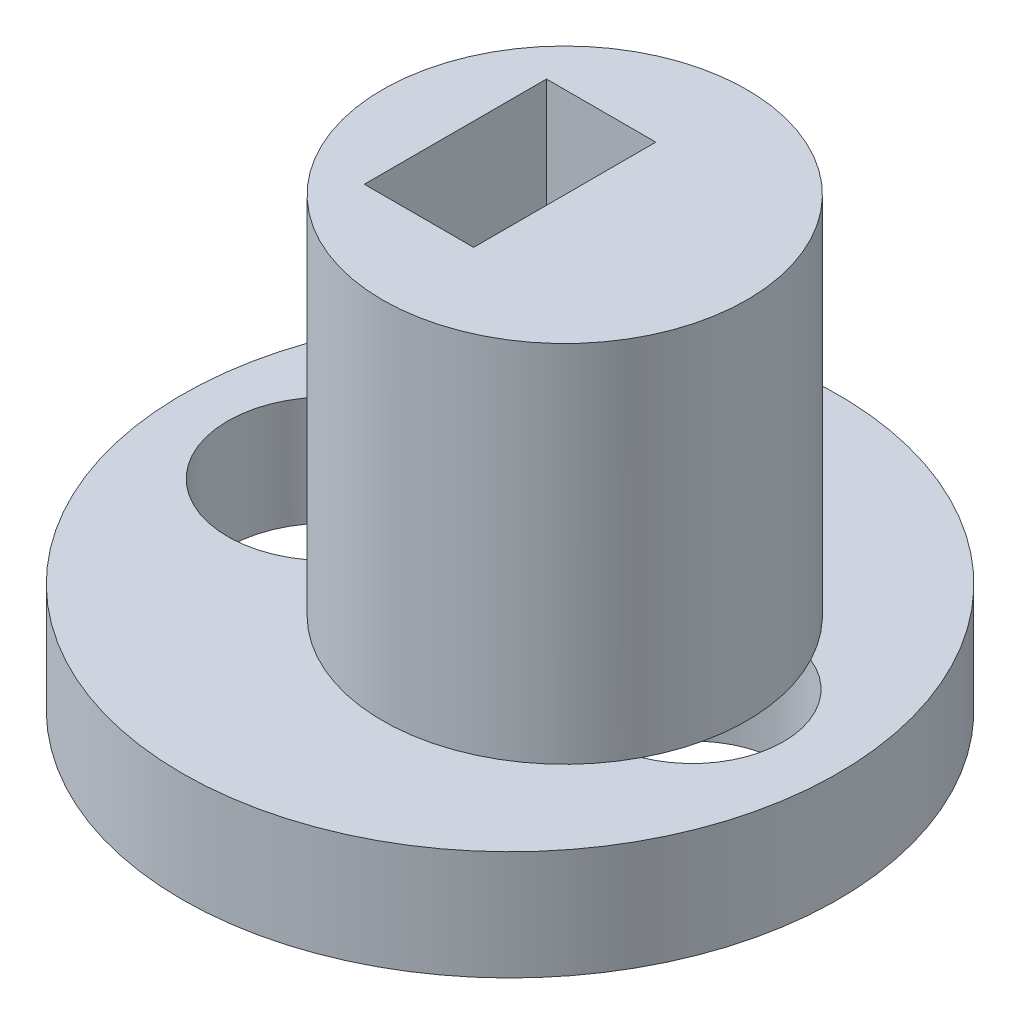
ISO-10303-21;
HEADER;
FILE_DESCRIPTION(('STEP AP214'),'2;1');
FILE_NAME('part.step','',(''),(''),'','','');
FILE_SCHEMA(('AUTOMOTIVE_DESIGN { 1 0 10303 214 1 1 1 1 }'));
ENDSEC;
DATA;
#1=APPLICATION_CONTEXT('core data for automotive mechanical design processes');
#2=APPLICATION_PROTOCOL_DEFINITION('international standard','automotive_design',2000,#1);
#3=PRODUCT_CONTEXT('',#1,'mechanical');
#4=PRODUCT('Part','Part','',(#3));
#5=PRODUCT_RELATED_PRODUCT_CATEGORY('part','',(#4));
#6=PRODUCT_DEFINITION_FORMATION('','',#4);
#7=PRODUCT_DEFINITION_CONTEXT('part definition',#1,'design');
#8=PRODUCT_DEFINITION('design','',#6,#7);
#9=PRODUCT_DEFINITION_SHAPE('','',#8);
#10=(LENGTH_UNIT() NAMED_UNIT(*) SI_UNIT(.MILLI.,.METRE.));
#11=(NAMED_UNIT(*) PLANE_ANGLE_UNIT() SI_UNIT($,.RADIAN.));
#12=(NAMED_UNIT(*) SI_UNIT($,.STERADIAN.) SOLID_ANGLE_UNIT());
#13=UNCERTAINTY_MEASURE_WITH_UNIT(LENGTH_MEASURE(1.E-05),#10,'distance_accuracy_value','');
#14=(GEOMETRIC_REPRESENTATION_CONTEXT(3) GLOBAL_UNCERTAINTY_ASSIGNED_CONTEXT((#13)) GLOBAL_UNIT_ASSIGNED_CONTEXT((#10,
#11,#12)) REPRESENTATION_CONTEXT('',''));
#15=CARTESIAN_POINT('',(0.,0.,0.));
#16=DIRECTION('',(0.,0.,1.));
#17=DIRECTION('',(1.,0.,0.));
#18=AXIS2_PLACEMENT_3D('',#15,#16,#17);
#19=CARTESIAN_POINT('',(0.,3.,0.));
#20=DIRECTION('',(0.,1.,0.));
#21=DIRECTION('',(0.,0.,1.));
#22=AXIS2_PLACEMENT_3D('',#19,#20,#21);
#23=PLANE('',#22);
#24=CARTESIAN_POINT('',(1.5,3.,0.));
#25=DIRECTION('',(0.,1.,0.));
#26=DIRECTION('',(0.,0.,1.));
#27=AXIS2_PLACEMENT_3D('',#24,#25,#26);
#28=CIRCLE('',#27,5.);
#29=CARTESIAN_POINT('',(5.92857142857143,3.,-2.32115382989599));
#30=VERTEX_POINT('',#29);
#31=CARTESIAN_POINT('',(-3.09109173493235,3.,-1.98037286424448));
#32=VERTEX_POINT('',#31);
#33=EDGE_CURVE('E11',#30,#32,#28,.T.);
#34=ORIENTED_EDGE('',*,*,#33,.F.);
#35=CARTESIAN_POINT('',(5.,3.,0.));
#36=DIRECTION('',(0.,1.,0.));
#37=DIRECTION('',(0.,0.,1.));
#38=AXIS2_PLACEMENT_3D('',#35,#36,#37);
#39=CIRCLE('',#38,2.5);
#40=CARTESIAN_POINT('',(5.92857142857143,3.,2.32115382989599));
#41=VERTEX_POINT('',#40);
#42=EDGE_CURVE('E146',#41,#30,#39,.T.);
#43=ORIENTED_EDGE('',*,*,#42,.F.);
#44=CARTESIAN_POINT('',(-3.09160052846454,3.,1.97919291303405));
#45=VERTEX_POINT('',#44);
#46=EDGE_CURVE('E48',#45,#41,#28,.T.);
#47=ORIENTED_EDGE('',*,*,#46,.F.);
#48=CARTESIAN_POINT('',(-5.,3.,-0.000835232483875));
#49=DIRECTION('',(0.,1.,0.));
#50=DIRECTION('',(0.,0.,1.));
#51=AXIS2_PLACEMENT_3D('',#48,#49,#50);
#52=CIRCLE('',#51,2.75);
#53=EDGE_CURVE('E65',#32,#45,#52,.T.);
#54=ORIENTED_EDGE('',*,*,#53,.F.);
#55=EDGE_LOOP('',(#34,#43,#47,#54));
#56=FACE_BOUND('',#55,.T.);
#57=CARTESIAN_POINT('',(0.,3.,0.));
#58=DIRECTION('',(0.,1.,0.));
#59=DIRECTION('',(0.,0.,1.));
#60=AXIS2_PLACEMENT_3D('',#57,#58,#59);
#61=CIRCLE('',#60,9.);
#62=CARTESIAN_POINT('',(0.,3.,9.));
#63=VERTEX_POINT('',#62);
#64=EDGE_CURVE('E151',#63,#63,#61,.T.);
#65=ORIENTED_EDGE('',*,*,#64,.T.);
#66=EDGE_LOOP('',(#65));
#67=FACE_BOUND('',#66,.T.);
#68=ADVANCED_FACE('F39',(#56,#67),#23,.T.);
#69=CARTESIAN_POINT('',(0.,0.,0.));
#70=DIRECTION('',(0.,1.,0.));
#71=DIRECTION('',(0.,0.,1.));
#72=AXIS2_PLACEMENT_3D('',#69,#70,#71);
#73=PLANE('',#72);
#74=CARTESIAN_POINT('',(0.,0.,0.));
#75=DIRECTION('',(0.,1.,0.));
#76=DIRECTION('',(0.,0.,1.));
#77=AXIS2_PLACEMENT_3D('',#74,#75,#76);
#78=CIRCLE('',#77,9.);
#79=CARTESIAN_POINT('',(0.,0.,9.));
#80=VERTEX_POINT('',#79);
#81=EDGE_CURVE('E43',#80,#80,#78,.T.);
#82=ORIENTED_EDGE('',*,*,#81,.F.);
#83=EDGE_LOOP('',(#82));
#84=FACE_BOUND('',#83,.T.);
#85=CARTESIAN_POINT('',(5.,0.,0.));
#86=DIRECTION('',(0.,1.,0.));
#87=DIRECTION('',(0.,0.,1.));
#88=AXIS2_PLACEMENT_3D('',#85,#86,#87);
#89=CIRCLE('',#88,2.5);
#90=CARTESIAN_POINT('',(5.,0.,2.5));
#91=VERTEX_POINT('',#90);
#92=EDGE_CURVE('E143',#91,#91,#89,.T.);
#93=ORIENTED_EDGE('',*,*,#92,.T.);
#94=EDGE_LOOP('',(#93));
#95=FACE_BOUND('',#94,.T.);
#96=CARTESIAN_POINT('',(-5.,0.,-0.000835232483875));
#97=DIRECTION('',(0.,1.,0.));
#98=DIRECTION('',(0.,0.,1.));
#99=AXIS2_PLACEMENT_3D('',#96,#97,#98);
#100=CIRCLE('',#99,2.75);
#101=CARTESIAN_POINT('',(-5.,0.,2.74916476751612));
#102=VERTEX_POINT('',#101);
#103=EDGE_CURVE('E137',#102,#102,#100,.T.);
#104=ORIENTED_EDGE('',*,*,#103,.T.);
#105=EDGE_LOOP('',(#104));
#106=FACE_BOUND('',#105,.T.);
#107=ADVANCED_FACE('F160',(#84,#95,#106),#73,.F.);
#108=CARTESIAN_POINT('',(0.,3.,0.));
#109=DIRECTION('',(0.,-1.,0.));
#110=DIRECTION('',(0.,0.,-1.));
#111=AXIS2_PLACEMENT_3D('',#108,#109,#110);
#112=CYLINDRICAL_SURFACE('',#111,9.);
#113=ORIENTED_EDGE('',*,*,#64,.F.);
#114=EDGE_LOOP('',(#113));
#115=FACE_BOUND('',#114,.T.);
#116=ORIENTED_EDGE('',*,*,#81,.T.);
#117=EDGE_LOOP('',(#116));
#118=FACE_BOUND('',#117,.T.);
#119=ADVANCED_FACE('F41',(#115,#118),#112,.T.);
#120=CARTESIAN_POINT('',(5.,3.,0.));
#121=DIRECTION('',(0.,-1.,0.));
#122=DIRECTION('',(0.,0.,-1.));
#123=AXIS2_PLACEMENT_3D('',#120,#121,#122);
#124=CYLINDRICAL_SURFACE('',#123,2.5);
#125=ORIENTED_EDGE('',*,*,#42,.T.);
#126=EDGE_CURVE('E149',#30,#41,#39,.T.);
#127=ORIENTED_EDGE('',*,*,#126,.T.);
#128=EDGE_LOOP('',(#125,#127));
#129=FACE_BOUND('',#128,.T.);
#130=ORIENTED_EDGE('',*,*,#92,.F.);
#131=EDGE_LOOP('',(#130));
#132=FACE_BOUND('',#131,.T.);
#133=ADVANCED_FACE('F170',(#129,#132),#124,.F.);
#134=CARTESIAN_POINT('',(-5.,3.,-0.000835232483875));
#135=DIRECTION('',(0.,-1.,0.));
#136=DIRECTION('',(0.,0.,-1.));
#137=AXIS2_PLACEMENT_3D('',#134,#135,#136);
#138=CYLINDRICAL_SURFACE('',#137,2.75);
#139=EDGE_CURVE('E141',#45,#32,#52,.T.);
#140=ORIENTED_EDGE('',*,*,#139,.T.);
#141=ORIENTED_EDGE('',*,*,#53,.T.);
#142=EDGE_LOOP('',(#140,#141));
#143=FACE_BOUND('',#142,.T.);
#144=ORIENTED_EDGE('',*,*,#103,.F.);
#145=EDGE_LOOP('',(#144));
#146=FACE_BOUND('',#145,.T.);
#147=ADVANCED_FACE('F167',(#143,#146),#138,.F.);
#148=CARTESIAN_POINT('',(1.5,3.,0.));
#149=DIRECTION('',(0.,1.,0.));
#150=DIRECTION('',(0.,0.,1.));
#151=AXIS2_PLACEMENT_3D('',#148,#149,#150);
#152=PLANE('',#151);
#153=ORIENTED_EDGE('',*,*,#126,.F.);
#154=EDGE_CURVE('E138',#41,#30,#28,.T.);
#155=ORIENTED_EDGE('',*,*,#154,.F.);
#156=EDGE_LOOP('',(#153,#155));
#157=FACE_BOUND('',#156,.T.);
#158=ADVANCED_FACE('F169',(#157),#152,.F.);
#159=CARTESIAN_POINT('',(1.5,13.,0.));
#160=DIRECTION('',(0.,1.,0.));
#161=DIRECTION('',(0.,0.,1.));
#162=AXIS2_PLACEMENT_3D('',#159,#160,#161);
#163=PLANE('',#162);
#164=CARTESIAN_POINT('',(1.5,13.,0.));
#165=DIRECTION('',(0.,1.,0.));
#166=DIRECTION('',(0.,0.,1.));
#167=AXIS2_PLACEMENT_3D('',#164,#165,#166);
#168=CIRCLE('',#167,5.);
#169=CARTESIAN_POINT('',(1.5,13.,5.));
#170=VERTEX_POINT('',#169);
#171=EDGE_CURVE('E135',#170,#170,#168,.T.);
#172=ORIENTED_EDGE('',*,*,#171,.T.);
#173=EDGE_LOOP('',(#172));
#174=FACE_BOUND('',#173,.T.);
#175=DIRECTION('',(0.,0.,-1.));
#176=VECTOR('',#175,1.);
#177=CARTESIAN_POINT('',(1.5,13.,2.5));
#178=LINE('',#177,#176);
#179=CARTESIAN_POINT('',(1.5,13.,2.5));
#180=VERTEX_POINT('',#179);
#181=CARTESIAN_POINT('',(1.5,13.,-2.5));
#182=VERTEX_POINT('',#181);
#183=EDGE_CURVE('E104',#180,#182,#178,.T.);
#184=ORIENTED_EDGE('',*,*,#183,.F.);
#185=DIRECTION('',(1.,0.,0.));
#186=VECTOR('',#185,1.);
#187=CARTESIAN_POINT('',(-1.5,13.,2.5));
#188=LINE('',#187,#186);
#189=CARTESIAN_POINT('',(-1.5,13.,2.5));
#190=VERTEX_POINT('',#189);
#191=EDGE_CURVE('E96',#190,#180,#188,.T.);
#192=ORIENTED_EDGE('',*,*,#191,.F.);
#193=DIRECTION('',(0.,0.,1.));
#194=VECTOR('',#193,1.);
#195=CARTESIAN_POINT('',(-1.5,13.,-2.5));
#196=LINE('',#195,#194);
#197=CARTESIAN_POINT('',(-1.5,13.,-2.5));
#198=VERTEX_POINT('',#197);
#199=EDGE_CURVE('E119',#198,#190,#196,.T.);
#200=ORIENTED_EDGE('',*,*,#199,.F.);
#201=DIRECTION('',(-1.,0.,0.));
#202=VECTOR('',#201,1.);
#203=CARTESIAN_POINT('',(1.5,13.,-2.5));
#204=LINE('',#203,#202);
#205=EDGE_CURVE('E117',#182,#198,#204,.T.);
#206=ORIENTED_EDGE('',*,*,#205,.F.);
#207=EDGE_LOOP('',(#184,#192,#200,#206));
#208=FACE_BOUND('',#207,.T.);
#209=ADVANCED_FACE('F115',(#174,#208),#163,.T.);
#210=ORIENTED_EDGE('',*,*,#139,.F.);
#211=EDGE_CURVE('E50',#32,#45,#28,.T.);
#212=ORIENTED_EDGE('',*,*,#211,.F.);
#213=EDGE_LOOP('',(#210,#212));
#214=FACE_BOUND('',#213,.T.);
#215=ADVANCED_FACE('F179',(#214),#152,.F.);
#216=CARTESIAN_POINT('',(1.5,13.,0.));
#217=DIRECTION('',(0.,-1.,0.));
#218=DIRECTION('',(0.,0.,-1.));
#219=AXIS2_PLACEMENT_3D('',#216,#217,#218);
#220=CYLINDRICAL_SURFACE('',#219,5.);
#221=ORIENTED_EDGE('',*,*,#171,.F.);
#222=EDGE_LOOP('',(#221));
#223=FACE_BOUND('',#222,.T.);
#224=ORIENTED_EDGE('',*,*,#154,.T.);
#225=ORIENTED_EDGE('',*,*,#33,.T.);
#226=ORIENTED_EDGE('',*,*,#211,.T.);
#227=ORIENTED_EDGE('',*,*,#46,.T.);
#228=EDGE_LOOP('',(#224,#225,#226,#227));
#229=FACE_BOUND('',#228,.T.);
#230=ADVANCED_FACE('F208',(#223,#229),#220,.T.);
#231=CARTESIAN_POINT('',(-1.5,13.,2.5));
#232=DIRECTION('',(0.,0.,-1.));
#233=DIRECTION('',(-1.,0.,0.));
#234=AXIS2_PLACEMENT_3D('',#231,#232,#233);
#235=PLANE('',#234);
#236=DIRECTION('',(1.,0.,0.));
#237=VECTOR('',#236,1.);
#238=CARTESIAN_POINT('',(-1.5,3.,2.5));
#239=LINE('',#238,#237);
#240=CARTESIAN_POINT('',(-1.5,3.,2.5));
#241=VERTEX_POINT('',#240);
#242=CARTESIAN_POINT('',(1.5,3.,2.5));
#243=VERTEX_POINT('',#242);
#244=EDGE_CURVE('E123',#241,#243,#239,.T.);
#245=ORIENTED_EDGE('',*,*,#244,.F.);
#246=DIRECTION('',(0.,-1.,0.));
#247=VECTOR('',#246,1.);
#248=CARTESIAN_POINT('',(-1.5,13.,2.5));
#249=LINE('',#248,#247);
#250=EDGE_CURVE('E57',#190,#241,#249,.T.);
#251=ORIENTED_EDGE('',*,*,#250,.F.);
#252=ORIENTED_EDGE('',*,*,#191,.T.);
#253=DIRECTION('',(0.,-1.,0.));
#254=VECTOR('',#253,1.);
#255=CARTESIAN_POINT('',(1.5,13.,2.5));
#256=LINE('',#255,#254);
#257=EDGE_CURVE('E99',#180,#243,#256,.T.);
#258=ORIENTED_EDGE('',*,*,#257,.T.);
#259=EDGE_LOOP('',(#245,#251,#252,#258));
#260=FACE_BOUND('',#259,.T.);
#261=ADVANCED_FACE('F98',(#260),#235,.T.);
#262=CARTESIAN_POINT('',(1.5,13.,2.5));
#263=DIRECTION('',(-1.,0.,0.));
#264=DIRECTION('',(0.,0.,1.));
#265=AXIS2_PLACEMENT_3D('',#262,#263,#264);
#266=PLANE('',#265);
#267=DIRECTION('',(0.,0.,-1.));
#268=VECTOR('',#267,1.);
#269=CARTESIAN_POINT('',(1.5,3.,2.5));
#270=LINE('',#269,#268);
#271=CARTESIAN_POINT('',(1.5,3.,-2.5));
#272=VERTEX_POINT('',#271);
#273=EDGE_CURVE('E111',#243,#272,#270,.T.);
#274=ORIENTED_EDGE('',*,*,#273,.F.);
#275=ORIENTED_EDGE('',*,*,#257,.F.);
#276=ORIENTED_EDGE('',*,*,#183,.T.);
#277=DIRECTION('',(0.,-1.,0.));
#278=VECTOR('',#277,1.);
#279=CARTESIAN_POINT('',(1.5,13.,-2.5));
#280=LINE('',#279,#278);
#281=EDGE_CURVE('E112',#182,#272,#280,.T.);
#282=ORIENTED_EDGE('',*,*,#281,.T.);
#283=EDGE_LOOP('',(#274,#275,#276,#282));
#284=FACE_BOUND('',#283,.T.);
#285=ADVANCED_FACE('F108',(#284),#266,.T.);
#286=CARTESIAN_POINT('',(1.5,13.,-2.5));
#287=DIRECTION('',(0.,0.,1.));
#288=DIRECTION('',(1.,0.,0.));
#289=AXIS2_PLACEMENT_3D('',#286,#287,#288);
#290=PLANE('',#289);
#291=DIRECTION('',(-1.,0.,0.));
#292=VECTOR('',#291,1.);
#293=CARTESIAN_POINT('',(1.5,3.,-2.5));
#294=LINE('',#293,#292);
#295=CARTESIAN_POINT('',(-1.5,3.,-2.5));
#296=VERTEX_POINT('',#295);
#297=EDGE_CURVE('E126',#272,#296,#294,.T.);
#298=ORIENTED_EDGE('',*,*,#297,.F.);
#299=ORIENTED_EDGE('',*,*,#281,.F.);
#300=ORIENTED_EDGE('',*,*,#205,.T.);
#301=DIRECTION('',(0.,-1.,0.));
#302=VECTOR('',#301,1.);
#303=CARTESIAN_POINT('',(-1.5,13.,-2.5));
#304=LINE('',#303,#302);
#305=EDGE_CURVE('E132',#198,#296,#304,.T.);
#306=ORIENTED_EDGE('',*,*,#305,.T.);
#307=EDGE_LOOP('',(#298,#299,#300,#306));
#308=FACE_BOUND('',#307,.T.);
#309=ADVANCED_FACE('F195',(#308),#290,.T.);
#310=CARTESIAN_POINT('',(-1.5,13.,-2.5));
#311=DIRECTION('',(1.,0.,0.));
#312=DIRECTION('',(0.,0.,-1.));
#313=AXIS2_PLACEMENT_3D('',#310,#311,#312);
#314=PLANE('',#313);
#315=DIRECTION('',(0.,0.,1.));
#316=VECTOR('',#315,1.);
#317=CARTESIAN_POINT('',(-1.5,3.,-2.5));
#318=LINE('',#317,#316);
#319=EDGE_CURVE('E105',#296,#241,#318,.T.);
#320=ORIENTED_EDGE('',*,*,#319,.F.);
#321=ORIENTED_EDGE('',*,*,#305,.F.);
#322=ORIENTED_EDGE('',*,*,#199,.T.);
#323=ORIENTED_EDGE('',*,*,#250,.T.);
#324=EDGE_LOOP('',(#320,#321,#322,#323));
#325=FACE_BOUND('',#324,.T.);
#326=ADVANCED_FACE('F190',(#325),#314,.T.);
#327=ORIENTED_EDGE('',*,*,#319,.T.);
#328=ORIENTED_EDGE('',*,*,#244,.T.);
#329=ORIENTED_EDGE('',*,*,#273,.T.);
#330=ORIENTED_EDGE('',*,*,#297,.T.);
#331=EDGE_LOOP('',(#327,#328,#329,#330));
#332=FACE_BOUND('',#331,.T.);
#333=ADVANCED_FACE('F185',(#332),#23,.T.);
#334=CLOSED_SHELL('',(#68,#107,#119,#133,#147,#158,#209,#215,#230,#261,#285,#309,#326,#333));
#335=MANIFOLD_SOLID_BREP('B2',#334);
#336=ADVANCED_BREP_SHAPE_REPRESENTATION('',(#18,#335),#14);
#337=SHAPE_DEFINITION_REPRESENTATION(#9,#336);
ENDSEC;
END-ISO-10303-21;
